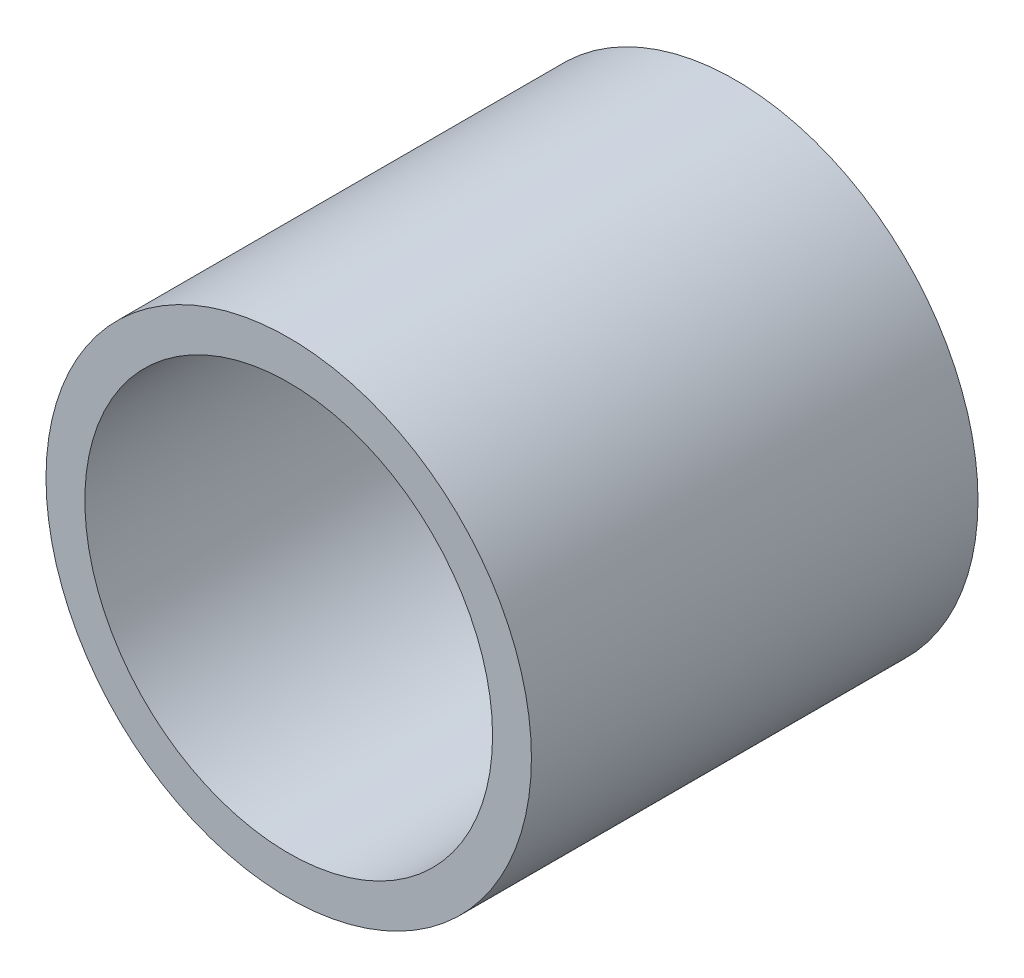
ISO-10303-21;
HEADER;
FILE_DESCRIPTION(('STEP AP214'),'2;1');
FILE_NAME('part.step','',(''),(''),'','','');
FILE_SCHEMA(('AUTOMOTIVE_DESIGN { 1 0 10303 214 1 1 1 1 }'));
ENDSEC;
DATA;
#1=APPLICATION_CONTEXT('core data for automotive mechanical design processes');
#2=APPLICATION_PROTOCOL_DEFINITION('international standard','automotive_design',2000,#1);
#3=PRODUCT_CONTEXT('',#1,'mechanical');
#4=PRODUCT('Part','Part','',(#3));
#5=PRODUCT_RELATED_PRODUCT_CATEGORY('part','',(#4));
#6=PRODUCT_DEFINITION_FORMATION('','',#4);
#7=PRODUCT_DEFINITION_CONTEXT('part definition',#1,'design');
#8=PRODUCT_DEFINITION('design','',#6,#7);
#9=PRODUCT_DEFINITION_SHAPE('','',#8);
#10=(LENGTH_UNIT() NAMED_UNIT(*) SI_UNIT(.MILLI.,.METRE.));
#11=(NAMED_UNIT(*) PLANE_ANGLE_UNIT() SI_UNIT($,.RADIAN.));
#12=(NAMED_UNIT(*) SI_UNIT($,.STERADIAN.) SOLID_ANGLE_UNIT());
#13=UNCERTAINTY_MEASURE_WITH_UNIT(LENGTH_MEASURE(1.E-05),#10,'distance_accuracy_value','');
#14=(GEOMETRIC_REPRESENTATION_CONTEXT(3) GLOBAL_UNCERTAINTY_ASSIGNED_CONTEXT((#13)) GLOBAL_UNIT_ASSIGNED_CONTEXT((#10,
#11,#12)) REPRESENTATION_CONTEXT('',''));
#15=CARTESIAN_POINT('',(0.,0.,0.));
#16=DIRECTION('',(0.,0.,1.));
#17=DIRECTION('',(1.,0.,0.));
#18=AXIS2_PLACEMENT_3D('',#15,#16,#17);
#19=CARTESIAN_POINT('',(0.,0.,23.));
#20=DIRECTION('',(0.,0.,-1.));
#21=DIRECTION('',(-1.,0.,0.));
#22=AXIS2_PLACEMENT_3D('',#19,#20,#21);
#23=CYLINDRICAL_SURFACE('',#22,12.5);
#24=CARTESIAN_POINT('',(0.,0.,23.));
#25=DIRECTION('',(0.,0.,1.));
#26=DIRECTION('',(1.,0.,0.));
#27=AXIS2_PLACEMENT_3D('',#24,#25,#26);
#28=CIRCLE('',#27,12.5);
#29=CARTESIAN_POINT('',(12.5,0.,23.));
#30=VERTEX_POINT('',#29);
#31=EDGE_CURVE('E10',#30,#30,#28,.T.);
#32=ORIENTED_EDGE('',*,*,#31,.F.);
#33=EDGE_LOOP('',(#32));
#34=FACE_BOUND('',#33,.T.);
#35=CARTESIAN_POINT('',(0.,0.,0.));
#36=DIRECTION('',(0.,0.,1.));
#37=DIRECTION('',(1.,0.,0.));
#38=AXIS2_PLACEMENT_3D('',#35,#36,#37);
#39=CIRCLE('',#38,12.5);
#40=CARTESIAN_POINT('',(12.5,0.,0.));
#41=VERTEX_POINT('',#40);
#42=EDGE_CURVE('E44',#41,#41,#39,.T.);
#43=ORIENTED_EDGE('',*,*,#42,.T.);
#44=EDGE_LOOP('',(#43));
#45=FACE_BOUND('',#44,.T.);
#46=ADVANCED_FACE('F41',(#34,#45),#23,.T.);
#47=CARTESIAN_POINT('',(0.,0.,23.));
#48=DIRECTION('',(0.,0.,1.));
#49=DIRECTION('',(1.,0.,0.));
#50=AXIS2_PLACEMENT_3D('',#47,#48,#49);
#51=PLANE('',#50);
#52=CARTESIAN_POINT('',(0.,0.,23.));
#53=DIRECTION('',(0.,0.,1.));
#54=DIRECTION('',(1.,0.,0.));
#55=AXIS2_PLACEMENT_3D('',#52,#53,#54);
#56=CIRCLE('',#55,10.5);
#57=CARTESIAN_POINT('',(10.5,0.,23.));
#58=VERTEX_POINT('',#57);
#59=EDGE_CURVE('E55',#58,#58,#56,.T.);
#60=ORIENTED_EDGE('',*,*,#59,.F.);
#61=EDGE_LOOP('',(#60));
#62=FACE_BOUND('',#61,.T.);
#63=ORIENTED_EDGE('',*,*,#31,.T.);
#64=EDGE_LOOP('',(#63));
#65=FACE_BOUND('',#64,.T.);
#66=ADVANCED_FACE('F72',(#62,#65),#51,.T.);
#67=CARTESIAN_POINT('',(0.,0.,0.));
#68=DIRECTION('',(0.,0.,1.));
#69=DIRECTION('',(1.,0.,0.));
#70=AXIS2_PLACEMENT_3D('',#67,#68,#69);
#71=PLANE('',#70);
#72=ORIENTED_EDGE('',*,*,#42,.F.);
#73=EDGE_LOOP('',(#72));
#74=FACE_BOUND('',#73,.T.);
#75=ADVANCED_FACE('F68',(#74),#71,.F.);
#76=CARTESIAN_POINT('',(0.,0.,3.));
#77=DIRECTION('',(0.,0.,1.));
#78=DIRECTION('',(1.,0.,0.));
#79=AXIS2_PLACEMENT_3D('',#76,#77,#78);
#80=CYLINDRICAL_SURFACE('',#79,10.5);
#81=CARTESIAN_POINT('',(0.,0.,3.));
#82=DIRECTION('',(0.,0.,1.));
#83=DIRECTION('',(1.,0.,0.));
#84=AXIS2_PLACEMENT_3D('',#81,#82,#83);
#85=CIRCLE('',#84,10.5);
#86=CARTESIAN_POINT('',(10.5,0.,3.));
#87=VERTEX_POINT('',#86);
#88=EDGE_CURVE('E53',#87,#87,#85,.T.);
#89=ORIENTED_EDGE('',*,*,#88,.F.);
#90=EDGE_LOOP('',(#89));
#91=FACE_BOUND('',#90,.T.);
#92=ORIENTED_EDGE('',*,*,#59,.T.);
#93=EDGE_LOOP('',(#92));
#94=FACE_BOUND('',#93,.T.);
#95=ADVANCED_FACE('F65',(#91,#94),#80,.F.);
#96=CARTESIAN_POINT('',(0.,0.,3.));
#97=DIRECTION('',(0.,0.,1.));
#98=DIRECTION('',(1.,0.,0.));
#99=AXIS2_PLACEMENT_3D('',#96,#97,#98);
#100=PLANE('',#99);
#101=ORIENTED_EDGE('',*,*,#88,.T.);
#102=EDGE_LOOP('',(#101));
#103=FACE_BOUND('',#102,.T.);
#104=ADVANCED_FACE('F63',(#103),#100,.T.);
#105=CLOSED_SHELL('',(#46,#66,#75,#95,#104));
#106=MANIFOLD_SOLID_BREP('B2',#105);
#107=ADVANCED_BREP_SHAPE_REPRESENTATION('',(#18,#106),#14);
#108=SHAPE_DEFINITION_REPRESENTATION(#9,#107);
ENDSEC;
END-ISO-10303-21;
